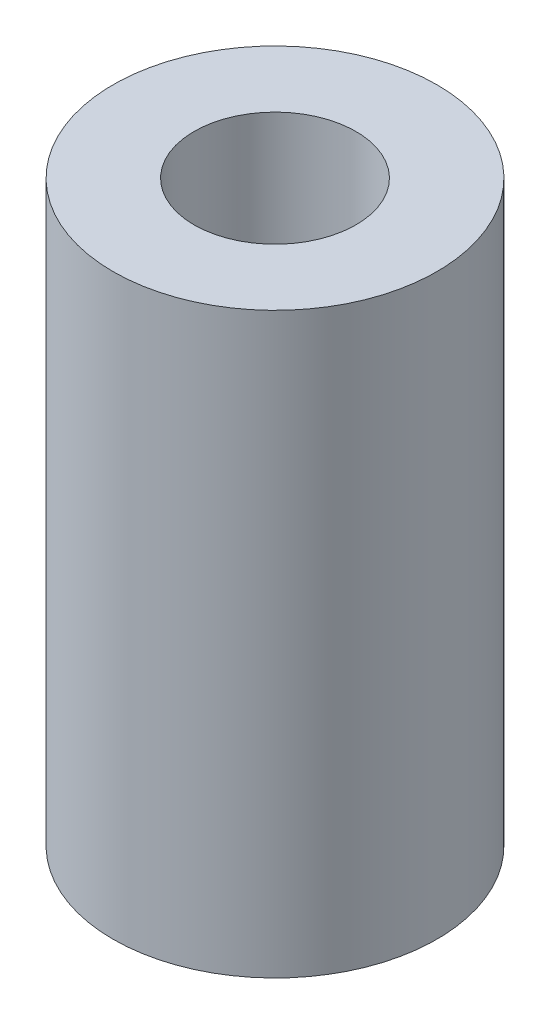
ISO-10303-21;
HEADER;
FILE_DESCRIPTION(('STEP AP214'),'2;1');
FILE_NAME('part.step','',(''),(''),'','','');
FILE_SCHEMA(('AUTOMOTIVE_DESIGN { 1 0 10303 214 1 1 1 1 }'));
ENDSEC;
DATA;
#1=APPLICATION_CONTEXT('core data for automotive mechanical design processes');
#2=APPLICATION_PROTOCOL_DEFINITION('international standard','automotive_design',2000,#1);
#3=PRODUCT_CONTEXT('',#1,'mechanical');
#4=PRODUCT('Part','Part','',(#3));
#5=PRODUCT_RELATED_PRODUCT_CATEGORY('part','',(#4));
#6=PRODUCT_DEFINITION_FORMATION('','',#4);
#7=PRODUCT_DEFINITION_CONTEXT('part definition',#1,'design');
#8=PRODUCT_DEFINITION('design','',#6,#7);
#9=PRODUCT_DEFINITION_SHAPE('','',#8);
#10=(LENGTH_UNIT() NAMED_UNIT(*) SI_UNIT(.MILLI.,.METRE.));
#11=(NAMED_UNIT(*) PLANE_ANGLE_UNIT() SI_UNIT($,.RADIAN.));
#12=(NAMED_UNIT(*) SI_UNIT($,.STERADIAN.) SOLID_ANGLE_UNIT());
#13=UNCERTAINTY_MEASURE_WITH_UNIT(LENGTH_MEASURE(1.E-05),#10,'distance_accuracy_value','');
#14=(GEOMETRIC_REPRESENTATION_CONTEXT(3) GLOBAL_UNCERTAINTY_ASSIGNED_CONTEXT((#13)) GLOBAL_UNIT_ASSIGNED_CONTEXT((#10,
#11,#12)) REPRESENTATION_CONTEXT('',''));
#15=CARTESIAN_POINT('',(0.,0.,0.));
#16=DIRECTION('',(0.,0.,1.));
#17=DIRECTION('',(1.,0.,0.));
#18=AXIS2_PLACEMENT_3D('',#15,#16,#17);
#19=CARTESIAN_POINT('',(0.,25.,0.));
#20=DIRECTION('',(0.,-1.,0.));
#21=DIRECTION('',(0.,0.,-1.));
#22=AXIS2_PLACEMENT_3D('',#19,#20,#21);
#23=CYLINDRICAL_SURFACE('',#22,3.5);
#24=CARTESIAN_POINT('',(0.,25.,0.));
#25=DIRECTION('',(0.,1.,0.));
#26=DIRECTION('',(0.,0.,1.));
#27=AXIS2_PLACEMENT_3D('',#24,#25,#26);
#28=CIRCLE('',#27,3.5);
#29=CARTESIAN_POINT('',(0.,25.,3.5));
#30=VERTEX_POINT('',#29);
#31=EDGE_CURVE('E38',#30,#30,#28,.T.);
#32=ORIENTED_EDGE('',*,*,#31,.T.);
#33=EDGE_LOOP('',(#32));
#34=FACE_BOUND('',#33,.T.);
#35=CARTESIAN_POINT('',(0.,0.,0.));
#36=DIRECTION('',(0.,1.,0.));
#37=DIRECTION('',(0.,0.,1.));
#38=AXIS2_PLACEMENT_3D('',#35,#36,#37);
#39=CIRCLE('',#38,3.5);
#40=CARTESIAN_POINT('',(0.,0.,3.5));
#41=VERTEX_POINT('',#40);
#42=EDGE_CURVE('E44',#41,#41,#39,.T.);
#43=ORIENTED_EDGE('',*,*,#42,.F.);
#44=EDGE_LOOP('',(#43));
#45=FACE_BOUND('',#44,.T.);
#46=ADVANCED_FACE('F31',(#34,#45),#23,.F.);
#47=CARTESIAN_POINT('',(0.,25.,0.));
#48=DIRECTION('',(0.,-1.,0.));
#49=DIRECTION('',(0.,0.,-1.));
#50=AXIS2_PLACEMENT_3D('',#47,#48,#49);
#51=CYLINDRICAL_SURFACE('',#50,7.);
#52=CARTESIAN_POINT('',(0.,25.,0.));
#53=DIRECTION('',(0.,1.,0.));
#54=DIRECTION('',(0.,0.,1.));
#55=AXIS2_PLACEMENT_3D('',#52,#53,#54);
#56=CIRCLE('',#55,7.);
#57=CARTESIAN_POINT('',(0.,25.,7.));
#58=VERTEX_POINT('',#57);
#59=EDGE_CURVE('E10',#58,#58,#56,.T.);
#60=ORIENTED_EDGE('',*,*,#59,.F.);
#61=EDGE_LOOP('',(#60));
#62=FACE_BOUND('',#61,.T.);
#63=CARTESIAN_POINT('',(0.,0.,0.));
#64=DIRECTION('',(0.,1.,0.));
#65=DIRECTION('',(0.,0.,1.));
#66=AXIS2_PLACEMENT_3D('',#63,#64,#65);
#67=CIRCLE('',#66,7.);
#68=CARTESIAN_POINT('',(0.,0.,7.));
#69=VERTEX_POINT('',#68);
#70=EDGE_CURVE('E34',#69,#69,#67,.T.);
#71=ORIENTED_EDGE('',*,*,#70,.T.);
#72=EDGE_LOOP('',(#71));
#73=FACE_BOUND('',#72,.T.);
#74=ADVANCED_FACE('F51',(#62,#73),#51,.T.);
#75=CARTESIAN_POINT('',(0.,25.,0.));
#76=DIRECTION('',(0.,1.,0.));
#77=DIRECTION('',(0.,0.,1.));
#78=AXIS2_PLACEMENT_3D('',#75,#76,#77);
#79=PLANE('',#78);
#80=ORIENTED_EDGE('',*,*,#31,.F.);
#81=EDGE_LOOP('',(#80));
#82=FACE_BOUND('',#81,.T.);
#83=ORIENTED_EDGE('',*,*,#59,.T.);
#84=EDGE_LOOP('',(#83));
#85=FACE_BOUND('',#84,.T.);
#86=ADVANCED_FACE('F55',(#82,#85),#79,.T.);
#87=CARTESIAN_POINT('',(0.,0.,0.));
#88=DIRECTION('',(0.,1.,0.));
#89=DIRECTION('',(0.,0.,1.));
#90=AXIS2_PLACEMENT_3D('',#87,#88,#89);
#91=PLANE('',#90);
#92=ORIENTED_EDGE('',*,*,#42,.T.);
#93=EDGE_LOOP('',(#92));
#94=FACE_BOUND('',#93,.T.);
#95=ORIENTED_EDGE('',*,*,#70,.F.);
#96=EDGE_LOOP('',(#95));
#97=FACE_BOUND('',#96,.T.);
#98=ADVANCED_FACE('F53',(#94,#97),#91,.F.);
#99=CLOSED_SHELL('',(#46,#74,#86,#98));
#100=MANIFOLD_SOLID_BREP('B2',#99);
#101=ADVANCED_BREP_SHAPE_REPRESENTATION('',(#18,#100),#14);
#102=SHAPE_DEFINITION_REPRESENTATION(#9,#101);
ENDSEC;
END-ISO-10303-21;
